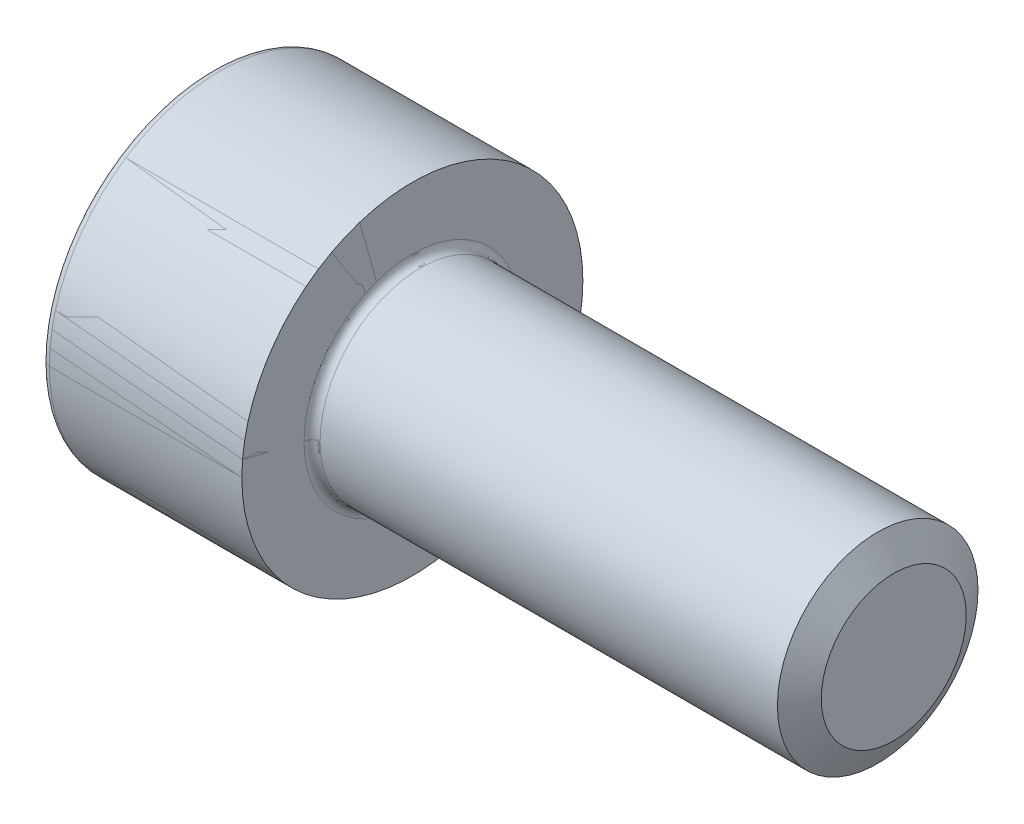
ISO-10303-21;
HEADER;
FILE_DESCRIPTION(('STEP AP214'),'2;1');
FILE_NAME('part.step','',(''),(''),'','','');
FILE_SCHEMA(('AUTOMOTIVE_DESIGN { 1 0 10303 214 1 1 1 1 }'));
ENDSEC;
DATA;
#1=APPLICATION_CONTEXT('core data for automotive mechanical design processes');
#2=APPLICATION_PROTOCOL_DEFINITION('international standard','automotive_design',2000,#1);
#3=PRODUCT_CONTEXT('',#1,'mechanical');
#4=PRODUCT('Part','Part','',(#3));
#5=PRODUCT_RELATED_PRODUCT_CATEGORY('part','',(#4));
#6=PRODUCT_DEFINITION_FORMATION('','',#4);
#7=PRODUCT_DEFINITION_CONTEXT('part definition',#1,'design');
#8=PRODUCT_DEFINITION('design','',#6,#7);
#9=PRODUCT_DEFINITION_SHAPE('','',#8);
#10=(LENGTH_UNIT() NAMED_UNIT(*) SI_UNIT(.MILLI.,.METRE.));
#11=(NAMED_UNIT(*) PLANE_ANGLE_UNIT() SI_UNIT($,.RADIAN.));
#12=(NAMED_UNIT(*) SI_UNIT($,.STERADIAN.) SOLID_ANGLE_UNIT());
#13=UNCERTAINTY_MEASURE_WITH_UNIT(LENGTH_MEASURE(1.E-05),#10,'distance_accuracy_value','');
#14=(GEOMETRIC_REPRESENTATION_CONTEXT(3) GLOBAL_UNCERTAINTY_ASSIGNED_CONTEXT((#13)) GLOBAL_UNIT_ASSIGNED_CONTEXT((#10,
#11,#12)) REPRESENTATION_CONTEXT('',''));
#15=CARTESIAN_POINT('',(0.,0.,0.));
#16=DIRECTION('',(0.,0.,1.));
#17=DIRECTION('',(1.,0.,0.));
#18=AXIS2_PLACEMENT_3D('',#15,#16,#17);
#19=CARTESIAN_POINT('',(0.2,0.,0.));
#20=DIRECTION('',(-1.,0.,0.));
#21=DIRECTION('',(0.,0.,1.));
#22=AXIS2_PLACEMENT_3D('',#19,#20,#21);
#23=TOROIDAL_SURFACE('',#22,4.05,0.2);
#24=CARTESIAN_POINT('',(0.2,0.,-4.05));
#25=DIRECTION('',(0.,1.,0.));
#26=DIRECTION('',(0.,0.,1.));
#27=AXIS2_PLACEMENT_3D('',#24,#25,#26);
#28=CIRCLE('',#27,0.2);
#29=CARTESIAN_POINT('',(0.2,0.,-4.25));
#30=VERTEX_POINT('',#29);
#31=CARTESIAN_POINT('',(0.,0.,-4.05));
#32=VERTEX_POINT('',#31);
#33=EDGE_CURVE('P0_E219',#30,#32,#28,.T.);
#34=ORIENTED_EDGE('',*,*,#33,.F.);
#35=CARTESIAN_POINT('',(0.2,0.,0.));
#36=DIRECTION('',(1.,0.,0.));
#37=DIRECTION('',(0.,0.,1.));
#38=AXIS2_PLACEMENT_3D('',#35,#36,#37);
#39=CIRCLE('',#38,4.25);
#40=CARTESIAN_POINT('',(0.2,0.,4.25));
#41=VERTEX_POINT('',#40);
#42=EDGE_CURVE('P0_E147',#41,#30,#39,.T.);
#43=ORIENTED_EDGE('',*,*,#42,.F.);
#44=CARTESIAN_POINT('',(0.2,0.,4.05));
#45=DIRECTION('',(0.,-1.,0.));
#46=DIRECTION('',(0.,0.,-1.));
#47=AXIS2_PLACEMENT_3D('',#44,#45,#46);
#48=CIRCLE('',#47,0.2);
#49=CARTESIAN_POINT('',(0.,0.,4.05));
#50=VERTEX_POINT('',#49);
#51=EDGE_CURVE('P0_E218',#41,#50,#48,.T.);
#52=ORIENTED_EDGE('',*,*,#51,.T.);
#53=CARTESIAN_POINT('',(0.,0.,0.));
#54=DIRECTION('',(-1.,0.,0.));
#55=DIRECTION('',(0.,0.,1.));
#56=AXIS2_PLACEMENT_3D('',#53,#54,#55);
#57=CIRCLE('',#56,4.05);
#58=EDGE_CURVE('P0_E178',#32,#50,#57,.T.);
#59=ORIENTED_EDGE('',*,*,#58,.F.);
#60=EDGE_LOOP('',(#34,#43,#52,#59));
#61=FACE_BOUND('',#60,.T.);
#62=ADVANCED_FACE('P0_F40',(#61),#23,.T.);
#63=CARTESIAN_POINT('',(2.5,-1.145,1.98319817466636));
#64=DIRECTION('',(-1.,0.,0.));
#65=DIRECTION('',(0.,0.,1.));
#66=AXIS2_PLACEMENT_3D('',#63,#64,#65);
#67=PLANE('',#66);
#68=DIRECTION('',(0.,0.5,0.866025403784439));
#69=VECTOR('',#68,1.);
#70=CARTESIAN_POINT('',(2.5,-2.29,0.));
#71=LINE('',#70,#69);
#72=CARTESIAN_POINT('',(2.5,-2.29,0.));
#73=VERTEX_POINT('',#72);
#74=CARTESIAN_POINT('',(2.5,-1.145,1.98319817466636));
#75=VERTEX_POINT('',#74);
#76=EDGE_CURVE('P0_E240',#73,#75,#71,.T.);
#77=ORIENTED_EDGE('',*,*,#76,.T.);
#78=DIRECTION('',(0.,1.,0.));
#79=VECTOR('',#78,1.);
#80=CARTESIAN_POINT('',(2.5,-1.145,1.98319817466636));
#81=LINE('',#80,#79);
#82=CARTESIAN_POINT('',(2.5,1.145,1.98319817466636));
#83=VERTEX_POINT('',#82);
#84=EDGE_CURVE('P0_E11',#75,#83,#81,.T.);
#85=ORIENTED_EDGE('',*,*,#84,.T.);
#86=DIRECTION('',(0.,0.5,-0.866025403784439));
#87=VECTOR('',#86,1.);
#88=CARTESIAN_POINT('',(2.5,1.145,1.98319817466636));
#89=LINE('',#88,#87);
#90=CARTESIAN_POINT('',(2.5,2.29,0.));
#91=VERTEX_POINT('',#90);
#92=EDGE_CURVE('P0_E187',#83,#91,#89,.T.);
#93=ORIENTED_EDGE('',*,*,#92,.T.);
#94=DIRECTION('',(0.,-0.5,-0.866025403784439));
#95=VECTOR('',#94,1.);
#96=CARTESIAN_POINT('',(2.5,2.29,0.));
#97=LINE('',#96,#95);
#98=CARTESIAN_POINT('',(2.5,1.145,-1.98319817466636));
#99=VERTEX_POINT('',#98);
#100=EDGE_CURVE('P0_E203',#91,#99,#97,.T.);
#101=ORIENTED_EDGE('',*,*,#100,.T.);
#102=DIRECTION('',(0.,-1.,0.));
#103=VECTOR('',#102,1.);
#104=CARTESIAN_POINT('',(2.5,1.145,-1.98319817466636));
#105=LINE('',#104,#103);
#106=CARTESIAN_POINT('',(2.5,-1.145,-1.98319817466636));
#107=VERTEX_POINT('',#106);
#108=EDGE_CURVE('P0_E204',#99,#107,#105,.T.);
#109=ORIENTED_EDGE('',*,*,#108,.T.);
#110=DIRECTION('',(0.,-0.5,0.866025403784439));
#111=VECTOR('',#110,1.);
#112=CARTESIAN_POINT('',(2.5,-1.145,-1.98319817466636));
#113=LINE('',#112,#111);
#114=EDGE_CURVE('P0_E244',#107,#73,#113,.T.);
#115=ORIENTED_EDGE('',*,*,#114,.T.);
#116=EDGE_LOOP('',(#77,#85,#93,#101,#109,#115));
#117=FACE_BOUND('',#116,.T.);
#118=ADVANCED_FACE('P0_F293',(#117),#67,.T.);
#119=CARTESIAN_POINT('',(2.5,-1.145,1.98319817466636));
#120=DIRECTION('',(0.,0.,1.));
#121=DIRECTION('',(0.,-1.,0.));
#122=AXIS2_PLACEMENT_3D('',#119,#120,#121);
#123=PLANE('',#122);
#124=DIRECTION('',(0.,1.,0.));
#125=VECTOR('',#124,1.);
#126=CARTESIAN_POINT('',(0.,-1.145,1.98319817466636));
#127=LINE('',#126,#125);
#128=CARTESIAN_POINT('',(0.,-1.145,1.98319817466636));
#129=VERTEX_POINT('',#128);
#130=CARTESIAN_POINT('',(0.,1.145,1.98319817466636));
#131=VERTEX_POINT('',#130);
#132=EDGE_CURVE('P0_E245',#129,#131,#127,.T.);
#133=ORIENTED_EDGE('',*,*,#132,.T.);
#134=DIRECTION('',(-1.,0.,0.));
#135=VECTOR('',#134,1.);
#136=CARTESIAN_POINT('',(2.5,1.145,1.98319817466636));
#137=LINE('',#136,#135);
#138=EDGE_CURVE('P0_E51',#83,#131,#137,.T.);
#139=ORIENTED_EDGE('',*,*,#138,.F.);
#140=ORIENTED_EDGE('',*,*,#84,.F.);
#141=DIRECTION('',(-1.,0.,0.));
#142=VECTOR('',#141,1.);
#143=CARTESIAN_POINT('',(2.5,-1.145,1.98319817466636));
#144=LINE('',#143,#142);
#145=EDGE_CURVE('P0_E236',#75,#129,#144,.T.);
#146=ORIENTED_EDGE('',*,*,#145,.T.);
#147=EDGE_LOOP('',(#133,#139,#140,#146));
#148=FACE_BOUND('',#147,.T.);
#149=ADVANCED_FACE('P0_F302',(#148),#123,.F.);
#150=CARTESIAN_POINT('',(2.5,1.145,1.98319817466636));
#151=DIRECTION('',(0.,0.866025403784439,0.5));
#152=DIRECTION('',(1.,0.,0.));
#153=AXIS2_PLACEMENT_3D('',#150,#151,#152);
#154=PLANE('',#153);
#155=DIRECTION('',(0.,0.5,-0.866025403784439));
#156=VECTOR('',#155,1.);
#157=CARTESIAN_POINT('',(0.,1.145,1.98319817466636));
#158=LINE('',#157,#156);
#159=CARTESIAN_POINT('',(0.,2.29,0.));
#160=VERTEX_POINT('',#159);
#161=EDGE_CURVE('P0_E194',#131,#160,#158,.T.);
#162=ORIENTED_EDGE('',*,*,#161,.T.);
#163=DIRECTION('',(-1.,0.,0.));
#164=VECTOR('',#163,1.);
#165=CARTESIAN_POINT('',(2.5,2.29,0.));
#166=LINE('',#165,#164);
#167=EDGE_CURVE('P0_E189',#91,#160,#166,.T.);
#168=ORIENTED_EDGE('',*,*,#167,.F.);
#169=ORIENTED_EDGE('',*,*,#92,.F.);
#170=ORIENTED_EDGE('',*,*,#138,.T.);
#171=EDGE_LOOP('',(#162,#168,#169,#170));
#172=FACE_BOUND('',#171,.T.);
#173=ADVANCED_FACE('P0_F274',(#172),#154,.F.);
#174=CARTESIAN_POINT('',(2.5,2.29,0.));
#175=DIRECTION('',(0.,0.866025403784439,-0.5));
#176=DIRECTION('',(-1.,0.,0.));
#177=AXIS2_PLACEMENT_3D('',#174,#175,#176);
#178=PLANE('',#177);
#179=DIRECTION('',(0.,-0.5,-0.866025403784439));
#180=VECTOR('',#179,1.);
#181=CARTESIAN_POINT('',(0.,2.29,0.));
#182=LINE('',#181,#180);
#183=CARTESIAN_POINT('',(0.,1.145,-1.98319817466636));
#184=VERTEX_POINT('',#183);
#185=EDGE_CURVE('P0_E190',#160,#184,#182,.T.);
#186=ORIENTED_EDGE('',*,*,#185,.T.);
#187=DIRECTION('',(-1.,0.,0.));
#188=VECTOR('',#187,1.);
#189=CARTESIAN_POINT('',(2.5,1.145,-1.98319817466636));
#190=LINE('',#189,#188);
#191=EDGE_CURVE('P0_E199',#99,#184,#190,.T.);
#192=ORIENTED_EDGE('',*,*,#191,.F.);
#193=ORIENTED_EDGE('',*,*,#100,.F.);
#194=ORIENTED_EDGE('',*,*,#167,.T.);
#195=EDGE_LOOP('',(#186,#192,#193,#194));
#196=FACE_BOUND('',#195,.T.);
#197=ADVANCED_FACE('P0_F286',(#196),#178,.F.);
#198=CARTESIAN_POINT('',(2.5,1.145,-1.98319817466636));
#199=DIRECTION('',(0.,0.,-1.));
#200=DIRECTION('',(0.,-1.,0.));
#201=AXIS2_PLACEMENT_3D('',#198,#199,#200);
#202=PLANE('',#201);
#203=DIRECTION('',(0.,-1.,0.));
#204=VECTOR('',#203,1.);
#205=CARTESIAN_POINT('',(0.,1.145,-1.98319817466636));
#206=LINE('',#205,#204);
#207=CARTESIAN_POINT('',(0.,-1.145,-1.98319817466636));
#208=VERTEX_POINT('',#207);
#209=EDGE_CURVE('P0_E195',#184,#208,#206,.T.);
#210=ORIENTED_EDGE('',*,*,#209,.T.);
#211=DIRECTION('',(-1.,0.,0.));
#212=VECTOR('',#211,1.);
#213=CARTESIAN_POINT('',(2.5,-1.145,-1.98319817466636));
#214=LINE('',#213,#212);
#215=EDGE_CURVE('P0_E241',#107,#208,#214,.T.);
#216=ORIENTED_EDGE('',*,*,#215,.F.);
#217=ORIENTED_EDGE('',*,*,#108,.F.);
#218=ORIENTED_EDGE('',*,*,#191,.T.);
#219=EDGE_LOOP('',(#210,#216,#217,#218));
#220=FACE_BOUND('',#219,.T.);
#221=ADVANCED_FACE('P0_F290',(#220),#202,.F.);
#222=CARTESIAN_POINT('',(2.5,-1.145,-1.98319817466636));
#223=DIRECTION('',(0.,-0.866025403784439,-0.5));
#224=DIRECTION('',(0.,0.5,-0.866025403784439));
#225=AXIS2_PLACEMENT_3D('',#222,#223,#224);
#226=PLANE('',#225);
#227=DIRECTION('',(0.,-0.5,0.866025403784439));
#228=VECTOR('',#227,1.);
#229=CARTESIAN_POINT('',(0.,-1.145,-1.98319817466636));
#230=LINE('',#229,#228);
#231=CARTESIAN_POINT('',(0.,-2.29,0.));
#232=VERTEX_POINT('',#231);
#233=EDGE_CURVE('P0_E213',#208,#232,#230,.T.);
#234=ORIENTED_EDGE('',*,*,#233,.T.);
#235=DIRECTION('',(-1.,0.,0.));
#236=VECTOR('',#235,1.);
#237=CARTESIAN_POINT('',(2.5,-2.29,0.));
#238=LINE('',#237,#236);
#239=EDGE_CURVE('P0_E252',#73,#232,#238,.T.);
#240=ORIENTED_EDGE('',*,*,#239,.F.);
#241=ORIENTED_EDGE('',*,*,#114,.F.);
#242=ORIENTED_EDGE('',*,*,#215,.T.);
#243=EDGE_LOOP('',(#234,#240,#241,#242));
#244=FACE_BOUND('',#243,.T.);
#245=ADVANCED_FACE('P0_F298',(#244),#226,.F.);
#246=CARTESIAN_POINT('',(2.5,-2.29,0.));
#247=DIRECTION('',(0.,-0.866025403784439,0.5));
#248=DIRECTION('',(-1.,0.,0.));
#249=AXIS2_PLACEMENT_3D('',#246,#247,#248);
#250=PLANE('',#249);
#251=DIRECTION('',(0.,0.5,0.866025403784439));
#252=VECTOR('',#251,1.);
#253=CARTESIAN_POINT('',(0.,-2.29,0.));
#254=LINE('',#253,#252);
#255=EDGE_CURVE('P0_E225',#232,#129,#254,.T.);
#256=ORIENTED_EDGE('',*,*,#255,.T.);
#257=ORIENTED_EDGE('',*,*,#145,.F.);
#258=ORIENTED_EDGE('',*,*,#76,.F.);
#259=ORIENTED_EDGE('',*,*,#239,.T.);
#260=EDGE_LOOP('',(#256,#257,#258,#259));
#261=FACE_BOUND('',#260,.T.);
#262=ADVANCED_FACE('P0_F300',(#261),#250,.F.);
#263=CARTESIAN_POINT('',(5.2,0.,0.));
#264=DIRECTION('',(1.,0.,0.));
#265=DIRECTION('',(0.,0.,-1.));
#266=AXIS2_PLACEMENT_3D('',#263,#264,#265);
#267=TOROIDAL_SURFACE('',#266,2.7,0.2);
#268=CARTESIAN_POINT('',(5.2,0.,2.7));
#269=DIRECTION('',(0.,1.,0.));
#270=DIRECTION('',(0.,0.,1.));
#271=AXIS2_PLACEMENT_3D('',#268,#269,#270);
#272=CIRCLE('',#271,0.2);
#273=CARTESIAN_POINT('',(5.2,0.,2.5));
#274=VERTEX_POINT('',#273);
#275=CARTESIAN_POINT('',(5.,0.,2.7));
#276=VERTEX_POINT('',#275);
#277=EDGE_CURVE('P0_E209',#274,#276,#272,.T.);
#278=ORIENTED_EDGE('',*,*,#277,.F.);
#279=CARTESIAN_POINT('',(5.2,0.,0.));
#280=DIRECTION('',(1.,0.,0.));
#281=DIRECTION('',(0.,0.,-1.));
#282=AXIS2_PLACEMENT_3D('',#279,#280,#281);
#283=CIRCLE('',#282,2.5);
#284=CARTESIAN_POINT('',(5.2,0.,-2.5));
#285=VERTEX_POINT('',#284);
#286=EDGE_CURVE('P0_E171',#285,#274,#283,.T.);
#287=ORIENTED_EDGE('',*,*,#286,.F.);
#288=CARTESIAN_POINT('',(5.2,0.,-2.7));
#289=DIRECTION('',(0.,-1.,0.));
#290=DIRECTION('',(0.,0.,-1.));
#291=AXIS2_PLACEMENT_3D('',#288,#289,#290);
#292=CIRCLE('',#291,0.2);
#293=CARTESIAN_POINT('',(5.,0.,-2.7));
#294=VERTEX_POINT('',#293);
#295=EDGE_CURVE('P0_E44',#285,#294,#292,.T.);
#296=ORIENTED_EDGE('',*,*,#295,.T.);
#297=CARTESIAN_POINT('',(5.,0.,0.));
#298=DIRECTION('',(1.,0.,0.));
#299=DIRECTION('',(0.,0.,-1.));
#300=AXIS2_PLACEMENT_3D('',#297,#298,#299);
#301=CIRCLE('',#300,2.7);
#302=EDGE_CURVE('P0_E133',#294,#276,#301,.T.);
#303=ORIENTED_EDGE('',*,*,#302,.T.);
#304=EDGE_LOOP('',(#278,#287,#296,#303));
#305=FACE_BOUND('',#304,.T.);
#306=ADVANCED_FACE('P0_F336',(#305),#267,.F.);
#307=CARTESIAN_POINT('',(5.,4.25,0.));
#308=DIRECTION('',(1.,0.,0.));
#309=DIRECTION('',(0.,1.,0.));
#310=AXIS2_PLACEMENT_3D('',#307,#308,#309);
#311=PLANE('',#310);
#312=ORIENTED_EDGE('',*,*,#302,.F.);
#313=CARTESIAN_POINT('',(5.,0.,0.));
#314=DIRECTION('',(1.,0.,0.));
#315=DIRECTION('',(0.,0.,-1.));
#316=AXIS2_PLACEMENT_3D('',#313,#314,#315);
#317=CIRCLE('',#316,2.7);
#318=EDGE_CURVE('P0_E205',#276,#294,#317,.T.);
#319=ORIENTED_EDGE('',*,*,#318,.F.);
#320=EDGE_LOOP('',(#312,#319));
#321=FACE_BOUND('',#320,.T.);
#322=CARTESIAN_POINT('',(5.,0.,0.));
#323=DIRECTION('',(1.,0.,0.));
#324=DIRECTION('',(0.,0.,-1.));
#325=AXIS2_PLACEMENT_3D('',#322,#323,#324);
#326=CIRCLE('',#325,4.25);
#327=CARTESIAN_POINT('',(5.,0.,-4.25));
#328=VERTEX_POINT('',#327);
#329=CARTESIAN_POINT('',(5.,0.,4.25));
#330=VERTEX_POINT('',#329);
#331=EDGE_CURVE('P0_E198',#328,#330,#326,.T.);
#332=ORIENTED_EDGE('',*,*,#331,.T.);
#333=CARTESIAN_POINT('',(5.,0.,0.));
#334=DIRECTION('',(1.,0.,0.));
#335=DIRECTION('',(0.,0.,-1.));
#336=AXIS2_PLACEMENT_3D('',#333,#334,#335);
#337=CIRCLE('',#336,4.25);
#338=EDGE_CURVE('P0_E237',#330,#328,#337,.T.);
#339=ORIENTED_EDGE('',*,*,#338,.T.);
#340=EDGE_LOOP('',(#332,#339));
#341=FACE_BOUND('',#340,.T.);
#342=ADVANCED_FACE('P0_F321',(#321,#341),#311,.T.);
#343=CARTESIAN_POINT('',(0.,0.,0.));
#344=DIRECTION('',(1.,0.,0.));
#345=DIRECTION('',(0.,0.,-1.));
#346=AXIS2_PLACEMENT_3D('',#343,#344,#345);
#347=CYLINDRICAL_SURFACE('',#346,4.25);
#348=DIRECTION('',(1.,0.,0.));
#349=VECTOR('',#348,1.);
#350=CARTESIAN_POINT('',(0.,0.,4.25));
#351=LINE('',#350,#349);
#352=EDGE_CURVE('P0_E185',#41,#330,#351,.T.);
#353=ORIENTED_EDGE('',*,*,#352,.F.);
#354=ORIENTED_EDGE('',*,*,#42,.T.);
#355=DIRECTION('',(1.,0.,0.));
#356=VECTOR('',#355,1.);
#357=CARTESIAN_POINT('',(0.,0.,-4.25));
#358=LINE('',#357,#356);
#359=EDGE_CURVE('P0_E181',#30,#328,#358,.T.);
#360=ORIENTED_EDGE('',*,*,#359,.T.);
#361=ORIENTED_EDGE('',*,*,#338,.F.);
#362=EDGE_LOOP('',(#353,#354,#360,#361));
#363=FACE_BOUND('',#362,.T.);
#364=ADVANCED_FACE('P0_F319',(#363),#347,.T.);
#365=CARTESIAN_POINT('',(0.,0.,0.));
#366=DIRECTION('',(-1.,0.,0.));
#367=DIRECTION('',(0.,0.,1.));
#368=AXIS2_PLACEMENT_3D('',#365,#366,#367);
#369=PLANE('',#368);
#370=ORIENTED_EDGE('',*,*,#255,.F.);
#371=ORIENTED_EDGE('',*,*,#233,.F.);
#372=ORIENTED_EDGE('',*,*,#209,.F.);
#373=ORIENTED_EDGE('',*,*,#185,.F.);
#374=ORIENTED_EDGE('',*,*,#161,.F.);
#375=ORIENTED_EDGE('',*,*,#132,.F.);
#376=EDGE_LOOP('',(#370,#371,#372,#373,#374,#375));
#377=FACE_BOUND('',#376,.T.);
#378=CARTESIAN_POINT('',(0.,0.,0.));
#379=DIRECTION('',(-1.,0.,0.));
#380=DIRECTION('',(0.,0.,1.));
#381=AXIS2_PLACEMENT_3D('',#378,#379,#380);
#382=CIRCLE('',#381,4.05);
#383=EDGE_CURVE('P0_E214',#50,#32,#382,.T.);
#384=ORIENTED_EDGE('',*,*,#383,.T.);
#385=ORIENTED_EDGE('',*,*,#58,.T.);
#386=EDGE_LOOP('',(#384,#385));
#387=FACE_BOUND('',#386,.T.);
#388=ADVANCED_FACE('P0_F281',(#377,#387),#369,.T.);
#389=CARTESIAN_POINT('',(0.,0.,0.));
#390=DIRECTION('',(1.,0.,0.));
#391=DIRECTION('',(0.,0.,-1.));
#392=AXIS2_PLACEMENT_3D('',#389,#390,#391);
#393=CYLINDRICAL_SURFACE('',#392,2.5);
#394=ORIENTED_EDGE('',*,*,#286,.T.);
#395=DIRECTION('',(1.,0.,0.));
#396=VECTOR('',#395,1.);
#397=CARTESIAN_POINT('',(0.,0.,2.5));
#398=LINE('',#397,#396);
#399=CARTESIAN_POINT('',(14.6,0.,2.5));
#400=VERTEX_POINT('',#399);
#401=EDGE_CURVE('P0_E167',#274,#400,#398,.T.);
#402=ORIENTED_EDGE('',*,*,#401,.T.);
#403=ORIENTED_EDGE('',*,*,#401,.F.);
#404=CARTESIAN_POINT('',(5.2,0.,0.));
#405=DIRECTION('',(1.,0.,0.));
#406=DIRECTION('',(0.,0.,-1.));
#407=AXIS2_PLACEMENT_3D('',#404,#405,#406);
#408=CIRCLE('',#407,2.5);
#409=EDGE_CURVE('P0_E226',#274,#285,#408,.T.);
#410=ORIENTED_EDGE('',*,*,#409,.T.);
#411=DIRECTION('',(1.,0.,0.));
#412=VECTOR('',#411,1.);
#413=CARTESIAN_POINT('',(0.,0.,-2.5));
#414=LINE('',#413,#412);
#415=CARTESIAN_POINT('',(14.6,0.,-2.5));
#416=VERTEX_POINT('',#415);
#417=EDGE_CURVE('P0_E122',#285,#416,#414,.T.);
#418=ORIENTED_EDGE('',*,*,#417,.T.);
#419=ORIENTED_EDGE('',*,*,#417,.F.);
#420=EDGE_LOOP('',(#394,#402,#403,#410,#418,#419));
#421=FACE_BOUND('',#420,.T.);
#422=CARTESIAN_POINT('',(16.6,0.,0.));
#423=DIRECTION('',(-1.,0.,0.));
#424=DIRECTION('',(0.,0.,1.));
#425=AXIS2_PLACEMENT_3D('',#422,#423,#424);
#426=CIRCLE('',#425,2.5);
#427=CARTESIAN_POINT('',(16.6,0.,2.5));
#428=VERTEX_POINT('',#427);
#429=EDGE_CURVE('P0_E370',#428,#428,#426,.T.);
#430=ORIENTED_EDGE('',*,*,#429,.T.);
#431=EDGE_LOOP('',(#430));
#432=FACE_BOUND('',#431,.T.);
#433=ADVANCED_FACE('P0_F168',(#421,#432),#393,.T.);
#434=CARTESIAN_POINT('',(0.,0.,0.));
#435=DIRECTION('',(1.,0.,0.));
#436=DIRECTION('',(0.,0.,-1.));
#437=AXIS2_PLACEMENT_3D('',#434,#435,#436);
#438=CYLINDRICAL_SURFACE('',#437,4.25);
#439=CARTESIAN_POINT('',(0.2,0.,0.));
#440=DIRECTION('',(1.,0.,0.));
#441=DIRECTION('',(0.,0.,1.));
#442=AXIS2_PLACEMENT_3D('',#439,#440,#441);
#443=CIRCLE('',#442,4.25);
#444=EDGE_CURVE('P0_E358',#30,#41,#443,.T.);
#445=ORIENTED_EDGE('',*,*,#444,.T.);
#446=ORIENTED_EDGE('',*,*,#352,.T.);
#447=ORIENTED_EDGE('',*,*,#331,.F.);
#448=ORIENTED_EDGE('',*,*,#359,.F.);
#449=EDGE_LOOP('',(#445,#446,#447,#448));
#450=FACE_BOUND('',#449,.T.);
#451=ADVANCED_FACE('P0_F42',(#450),#438,.T.);
#452=CARTESIAN_POINT('',(5.2,0.,0.));
#453=DIRECTION('',(1.,0.,0.));
#454=DIRECTION('',(0.,0.,-1.));
#455=AXIS2_PLACEMENT_3D('',#452,#453,#454);
#456=TOROIDAL_SURFACE('',#455,2.7,0.2);
#457=ORIENTED_EDGE('',*,*,#409,.F.);
#458=ORIENTED_EDGE('',*,*,#277,.T.);
#459=ORIENTED_EDGE('',*,*,#318,.T.);
#460=ORIENTED_EDGE('',*,*,#295,.F.);
#461=EDGE_LOOP('',(#457,#458,#459,#460));
#462=FACE_BOUND('',#461,.T.);
#463=ADVANCED_FACE('P0_F331',(#462),#456,.F.);
#464=CARTESIAN_POINT('',(0.2,0.,0.));
#465=DIRECTION('',(-1.,0.,0.));
#466=DIRECTION('',(0.,0.,1.));
#467=AXIS2_PLACEMENT_3D('',#464,#465,#466);
#468=TOROIDAL_SURFACE('',#467,4.05,0.2);
#469=ORIENTED_EDGE('',*,*,#444,.F.);
#470=ORIENTED_EDGE('',*,*,#33,.T.);
#471=ORIENTED_EDGE('',*,*,#383,.F.);
#472=ORIENTED_EDGE('',*,*,#51,.F.);
#473=EDGE_LOOP('',(#469,#470,#471,#472));
#474=FACE_BOUND('',#473,.T.);
#475=ADVANCED_FACE('P0_F327',(#474),#468,.T.);
#476=CARTESIAN_POINT('',(17.,0.,0.));
#477=DIRECTION('',(-1.,0.,0.));
#478=DIRECTION('',(0.,0.,1.));
#479=AXIS2_PLACEMENT_3D('',#476,#477,#478);
#480=PLANE('',#479);
#481=CARTESIAN_POINT('',(17.,0.,0.));
#482=DIRECTION('',(-1.,0.,0.));
#483=DIRECTION('',(0.,0.,1.));
#484=AXIS2_PLACEMENT_3D('',#481,#482,#483);
#485=CIRCLE('',#484,1.8072);
#486=CARTESIAN_POINT('',(17.,0.,1.8072));
#487=VERTEX_POINT('',#486);
#488=EDGE_CURVE('P0_E360',#487,#487,#485,.T.);
#489=ORIENTED_EDGE('',*,*,#488,.F.);
#490=EDGE_LOOP('',(#489));
#491=FACE_BOUND('',#490,.T.);
#492=ADVANCED_FACE('P0_F330',(#491),#480,.F.);
#493=CARTESIAN_POINT('',(17.,0.,0.));
#494=DIRECTION('',(-1.,0.,0.));
#495=DIRECTION('',(0.,0.,1.));
#496=AXIS2_PLACEMENT_3D('',#493,#494,#495);
#497=CONICAL_SURFACE('',#496,1.8072,1.04718484902493);
#498=ORIENTED_EDGE('',*,*,#429,.F.);
#499=EDGE_LOOP('',(#498));
#500=FACE_BOUND('',#499,.T.);
#501=ORIENTED_EDGE('',*,*,#488,.T.);
#502=EDGE_LOOP('',(#501));
#503=FACE_BOUND('',#502,.T.);
#504=ADVANCED_FACE('P0_F374',(#500,#503),#497,.T.);
#505=CLOSED_SHELL('',(#62,#118,#149,#173,#197,#221,#245,#262,#306,#342,#364,#388,#433,#451,#463,
#475,#492,#504));
#506=MANIFOLD_SOLID_BREP('P0_B2',#505);
#507=CARTESIAN_POINT('',(15.,2.5,0.));
#508=DIRECTION('',(1.,0.,0.));
#509=DIRECTION('',(0.,1.,0.));
#510=AXIS2_PLACEMENT_3D('',#507,#508,#509);
#511=PLANE('',#510);
#512=CARTESIAN_POINT('',(15.,0.,0.));
#513=DIRECTION('',(-1.,0.,0.));
#514=DIRECTION('',(0.,0.,1.));
#515=AXIS2_PLACEMENT_3D('',#512,#513,#514);
#516=CIRCLE('',#515,1.8072);
#517=CARTESIAN_POINT('',(15.,0.,1.8072));
#518=VERTEX_POINT('',#517);
#519=CARTESIAN_POINT('',(15.,0.,-1.8072));
#520=VERTEX_POINT('',#519);
#521=EDGE_CURVE('P1_E198',#518,#520,#516,.T.);
#522=ORIENTED_EDGE('',*,*,#521,.F.);
#523=CARTESIAN_POINT('',(15.,0.,0.));
#524=DIRECTION('',(-1.,0.,0.));
#525=DIRECTION('',(0.,0.,1.));
#526=AXIS2_PLACEMENT_3D('',#523,#524,#525);
#527=CIRCLE('',#526,1.8072);
#528=EDGE_CURVE('P1_E11',#520,#518,#527,.T.);
#529=ORIENTED_EDGE('',*,*,#528,.F.);
#530=EDGE_LOOP('',(#522,#529));
#531=FACE_BOUND('',#530,.T.);
#532=ADVANCED_FACE('P1_F16',(#531),#511,.T.);
#533=CARTESIAN_POINT('',(14.6,0.,0.));
#534=DIRECTION('',(-1.,0.,0.));
#535=DIRECTION('',(0.,0.,1.));
#536=AXIS2_PLACEMENT_3D('',#533,#534,#535);
#537=CONICAL_SURFACE('',#536,2.5,1.04718484902493);
#538=DIRECTION('',(-0.500011000363013,0.,-0.86601905262874));
#539=VECTOR('',#538,1.);
#540=CARTESIAN_POINT('',(14.6,0.,-2.5));
#541=LINE('',#540,#539);
#542=CARTESIAN_POINT('',(14.6,0.,-2.5));
#543=VERTEX_POINT('',#542);
#544=EDGE_CURVE('P1_E171',#520,#543,#541,.T.);
#545=ORIENTED_EDGE('',*,*,#544,.F.);
#546=ORIENTED_EDGE('',*,*,#528,.T.);
#547=DIRECTION('',(-0.500011000363013,0.,0.86601905262874));
#548=VECTOR('',#547,1.);
#549=CARTESIAN_POINT('',(14.6,0.,2.5));
#550=LINE('',#549,#548);
#551=CARTESIAN_POINT('',(14.6,0.,2.5));
#552=VERTEX_POINT('',#551);
#553=EDGE_CURVE('P1_E20',#518,#552,#550,.T.);
#554=ORIENTED_EDGE('',*,*,#553,.T.);
#555=CARTESIAN_POINT('',(14.6,0.,0.));
#556=DIRECTION('',(-1.,0.,0.));
#557=DIRECTION('',(0.,0.,1.));
#558=AXIS2_PLACEMENT_3D('',#555,#556,#557);
#559=CIRCLE('',#558,2.5);
#560=EDGE_CURVE('P1_E182',#543,#552,#559,.T.);
#561=ORIENTED_EDGE('',*,*,#560,.F.);
#562=EDGE_LOOP('',(#545,#546,#554,#561));
#563=FACE_BOUND('',#562,.T.);
#564=ADVANCED_FACE('P1_F18',(#563),#537,.T.);
#565=CARTESIAN_POINT('',(0.2,0.,0.));
#566=DIRECTION('',(-1.,0.,0.));
#567=DIRECTION('',(0.,0.,1.));
#568=AXIS2_PLACEMENT_3D('',#565,#566,#567);
#569=TOROIDAL_SURFACE('',#568,4.05,0.2);
#570=CARTESIAN_POINT('',(0.2,0.,-4.05));
#571=DIRECTION('',(0.,1.,0.));
#572=DIRECTION('',(0.,0.,1.));
#573=AXIS2_PLACEMENT_3D('',#570,#571,#572);
#574=CIRCLE('',#573,0.2);
#575=CARTESIAN_POINT('',(0.2,0.,-4.25));
#576=VERTEX_POINT('',#575);
#577=CARTESIAN_POINT('',(0.,0.,-4.05));
#578=VERTEX_POINT('',#577);
#579=EDGE_CURVE('P1_E336',#576,#578,#574,.T.);
#580=ORIENTED_EDGE('',*,*,#579,.F.);
#581=CARTESIAN_POINT('',(0.2,0.,0.));
#582=DIRECTION('',(1.,0.,0.));
#583=DIRECTION('',(0.,0.,1.));
#584=AXIS2_PLACEMENT_3D('',#581,#582,#583);
#585=CIRCLE('',#584,4.25);
#586=CARTESIAN_POINT('',(0.2,0.,4.25));
#587=VERTEX_POINT('',#586);
#588=EDGE_CURVE('P1_E146',#587,#576,#585,.T.);
#589=ORIENTED_EDGE('',*,*,#588,.F.);
#590=CARTESIAN_POINT('',(0.2,0.,4.05));
#591=DIRECTION('',(0.,-1.,0.));
#592=DIRECTION('',(0.,0.,-1.));
#593=AXIS2_PLACEMENT_3D('',#590,#591,#592);
#594=CIRCLE('',#593,0.2);
#595=CARTESIAN_POINT('',(0.,0.,4.05));
#596=VERTEX_POINT('',#595);
#597=EDGE_CURVE('P1_E365',#587,#596,#594,.T.);
#598=ORIENTED_EDGE('',*,*,#597,.T.);
#599=CARTESIAN_POINT('',(0.,0.,0.));
#600=DIRECTION('',(-1.,0.,0.));
#601=DIRECTION('',(0.,0.,1.));
#602=AXIS2_PLACEMENT_3D('',#599,#600,#601);
#603=CIRCLE('',#602,4.05);
#604=EDGE_CURVE('P1_E217',#578,#596,#603,.T.);
#605=ORIENTED_EDGE('',*,*,#604,.F.);
#606=EDGE_LOOP('',(#580,#589,#598,#605));
#607=FACE_BOUND('',#606,.T.);
#608=ADVANCED_FACE('P1_F276',(#607),#569,.T.);
#609=CARTESIAN_POINT('',(2.5,-1.145,1.98319817466636));
#610=DIRECTION('',(-1.,0.,0.));
#611=DIRECTION('',(0.,0.,1.));
#612=AXIS2_PLACEMENT_3D('',#609,#610,#611);
#613=PLANE('',#612);
#614=DIRECTION('',(0.,0.5,0.866025403784439));
#615=VECTOR('',#614,1.);
#616=CARTESIAN_POINT('',(2.5,-2.29,0.));
#617=LINE('',#616,#615);
#618=CARTESIAN_POINT('',(2.5,-2.29,0.));
#619=VERTEX_POINT('',#618);
#620=CARTESIAN_POINT('',(2.5,-1.145,1.98319817466636));
#621=VERTEX_POINT('',#620);
#622=EDGE_CURVE('P1_E114',#619,#621,#617,.T.);
#623=ORIENTED_EDGE('',*,*,#622,.T.);
#624=DIRECTION('',(0.,1.,0.));
#625=VECTOR('',#624,1.);
#626=CARTESIAN_POINT('',(2.5,-1.145,1.98319817466636));
#627=LINE('',#626,#625);
#628=CARTESIAN_POINT('',(2.5,1.145,1.98319817466636));
#629=VERTEX_POINT('',#628);
#630=EDGE_CURVE('P1_E27',#621,#629,#627,.T.);
#631=ORIENTED_EDGE('',*,*,#630,.T.);
#632=DIRECTION('',(0.,0.5,-0.866025403784439));
#633=VECTOR('',#632,1.);
#634=CARTESIAN_POINT('',(2.5,1.145,1.98319817466636));
#635=LINE('',#634,#633);
#636=CARTESIAN_POINT('',(2.5,2.29,0.));
#637=VERTEX_POINT('',#636);
#638=EDGE_CURVE('P1_E173',#629,#637,#635,.T.);
#639=ORIENTED_EDGE('',*,*,#638,.T.);
#640=DIRECTION('',(0.,-0.5,-0.866025403784439));
#641=VECTOR('',#640,1.);
#642=CARTESIAN_POINT('',(2.5,2.29,0.));
#643=LINE('',#642,#641);
#644=CARTESIAN_POINT('',(2.5,1.145,-1.98319817466636));
#645=VERTEX_POINT('',#644);
#646=EDGE_CURVE('P1_E183',#637,#645,#643,.T.);
#647=ORIENTED_EDGE('',*,*,#646,.T.);
#648=DIRECTION('',(0.,-1.,0.));
#649=VECTOR('',#648,1.);
#650=CARTESIAN_POINT('',(2.5,1.145,-1.98319817466636));
#651=LINE('',#650,#649);
#652=CARTESIAN_POINT('',(2.5,-1.145,-1.98319817466636));
#653=VERTEX_POINT('',#652);
#654=EDGE_CURVE('P1_E142',#645,#653,#651,.T.);
#655=ORIENTED_EDGE('',*,*,#654,.T.);
#656=DIRECTION('',(0.,-0.5,0.866025403784439));
#657=VECTOR('',#656,1.);
#658=CARTESIAN_POINT('',(2.5,-1.145,-1.98319817466636));
#659=LINE('',#658,#657);
#660=EDGE_CURVE('P1_E117',#653,#619,#659,.T.);
#661=ORIENTED_EDGE('',*,*,#660,.T.);
#662=EDGE_LOOP('',(#623,#631,#639,#647,#655,#661));
#663=FACE_BOUND('',#662,.T.);
#664=ADVANCED_FACE('P1_F115',(#663),#613,.T.);
#665=CARTESIAN_POINT('',(2.5,-1.145,1.98319817466636));
#666=DIRECTION('',(0.,0.,1.));
#667=DIRECTION('',(0.,-1.,0.));
#668=AXIS2_PLACEMENT_3D('',#665,#666,#667);
#669=PLANE('',#668);
#670=DIRECTION('',(0.,1.,0.));
#671=VECTOR('',#670,1.);
#672=CARTESIAN_POINT('',(0.,-1.145,1.98319817466636));
#673=LINE('',#672,#671);
#674=CARTESIAN_POINT('',(0.,-1.145,1.98319817466636));
#675=VERTEX_POINT('',#674);
#676=CARTESIAN_POINT('',(0.,1.145,1.98319817466636));
#677=VERTEX_POINT('',#676);
#678=EDGE_CURVE('P1_E143',#675,#677,#673,.T.);
#679=ORIENTED_EDGE('',*,*,#678,.T.);
#680=DIRECTION('',(-1.,0.,0.));
#681=VECTOR('',#680,1.);
#682=CARTESIAN_POINT('',(2.5,1.145,1.98319817466636));
#683=LINE('',#682,#681);
#684=EDGE_CURVE('P1_E109',#629,#677,#683,.T.);
#685=ORIENTED_EDGE('',*,*,#684,.F.);
#686=ORIENTED_EDGE('',*,*,#630,.F.);
#687=DIRECTION('',(-1.,0.,0.));
#688=VECTOR('',#687,1.);
#689=CARTESIAN_POINT('',(2.5,-1.145,1.98319817466636));
#690=LINE('',#689,#688);
#691=EDGE_CURVE('P1_E107',#621,#675,#690,.T.);
#692=ORIENTED_EDGE('',*,*,#691,.T.);
#693=EDGE_LOOP('',(#679,#685,#686,#692));
#694=FACE_BOUND('',#693,.T.);
#695=ADVANCED_FACE('P1_F105',(#694),#669,.F.);
#696=CARTESIAN_POINT('',(2.5,1.145,1.98319817466636));
#697=DIRECTION('',(0.,0.866025403784439,0.5));
#698=DIRECTION('',(1.,0.,0.));
#699=AXIS2_PLACEMENT_3D('',#696,#697,#698);
#700=PLANE('',#699);
#701=DIRECTION('',(0.,0.5,-0.866025403784439));
#702=VECTOR('',#701,1.);
#703=CARTESIAN_POINT('',(0.,1.145,1.98319817466636));
#704=LINE('',#703,#702);
#705=CARTESIAN_POINT('',(0.,2.29,0.));
#706=VERTEX_POINT('',#705);
#707=EDGE_CURVE('P1_E147',#677,#706,#704,.T.);
#708=ORIENTED_EDGE('',*,*,#707,.T.);
#709=DIRECTION('',(-1.,0.,0.));
#710=VECTOR('',#709,1.);
#711=CARTESIAN_POINT('',(2.5,2.29,0.));
#712=LINE('',#711,#710);
#713=EDGE_CURVE('P1_E187',#637,#706,#712,.T.);
#714=ORIENTED_EDGE('',*,*,#713,.F.);
#715=ORIENTED_EDGE('',*,*,#638,.F.);
#716=ORIENTED_EDGE('',*,*,#684,.T.);
#717=EDGE_LOOP('',(#708,#714,#715,#716));
#718=FACE_BOUND('',#717,.T.);
#719=ADVANCED_FACE('P1_F284',(#718),#700,.F.);
#720=CARTESIAN_POINT('',(2.5,2.29,0.));
#721=DIRECTION('',(0.,0.866025403784439,-0.5));
#722=DIRECTION('',(-1.,0.,0.));
#723=AXIS2_PLACEMENT_3D('',#720,#721,#722);
#724=PLANE('',#723);
#725=DIRECTION('',(0.,-0.5,-0.866025403784439));
#726=VECTOR('',#725,1.);
#727=CARTESIAN_POINT('',(0.,2.29,0.));
#728=LINE('',#727,#726);
#729=CARTESIAN_POINT('',(0.,1.145,-1.98319817466636));
#730=VERTEX_POINT('',#729);
#731=EDGE_CURVE('P1_E191',#706,#730,#728,.T.);
#732=ORIENTED_EDGE('',*,*,#731,.T.);
#733=DIRECTION('',(-1.,0.,0.));
#734=VECTOR('',#733,1.);
#735=CARTESIAN_POINT('',(2.5,1.145,-1.98319817466636));
#736=LINE('',#735,#734);
#737=EDGE_CURVE('P1_E166',#645,#730,#736,.T.);
#738=ORIENTED_EDGE('',*,*,#737,.F.);
#739=ORIENTED_EDGE('',*,*,#646,.F.);
#740=ORIENTED_EDGE('',*,*,#713,.T.);
#741=EDGE_LOOP('',(#732,#738,#739,#740));
#742=FACE_BOUND('',#741,.T.);
#743=ADVANCED_FACE('P1_F289',(#742),#724,.F.);
#744=CARTESIAN_POINT('',(2.5,1.145,-1.98319817466636));
#745=DIRECTION('',(0.,0.,-1.));
#746=DIRECTION('',(0.,-1.,0.));
#747=AXIS2_PLACEMENT_3D('',#744,#745,#746);
#748=PLANE('',#747);
#749=DIRECTION('',(0.,-1.,0.));
#750=VECTOR('',#749,1.);
#751=CARTESIAN_POINT('',(0.,1.145,-1.98319817466636));
#752=LINE('',#751,#750);
#753=CARTESIAN_POINT('',(0.,-1.145,-1.98319817466636));
#754=VERTEX_POINT('',#753);
#755=EDGE_CURVE('P1_E224',#730,#754,#752,.T.);
#756=ORIENTED_EDGE('',*,*,#755,.T.);
#757=DIRECTION('',(-1.,0.,0.));
#758=VECTOR('',#757,1.);
#759=CARTESIAN_POINT('',(2.5,-1.145,-1.98319817466636));
#760=LINE('',#759,#758);
#761=EDGE_CURVE('P1_E140',#653,#754,#760,.T.);
#762=ORIENTED_EDGE('',*,*,#761,.F.);
#763=ORIENTED_EDGE('',*,*,#654,.F.);
#764=ORIENTED_EDGE('',*,*,#737,.T.);
#765=EDGE_LOOP('',(#756,#762,#763,#764));
#766=FACE_BOUND('',#765,.T.);
#767=ADVANCED_FACE('P1_F306',(#766),#748,.F.);
#768=CARTESIAN_POINT('',(2.5,-1.145,-1.98319817466636));
#769=DIRECTION('',(0.,-0.866025403784439,-0.5));
#770=DIRECTION('',(0.,0.5,-0.866025403784439));
#771=AXIS2_PLACEMENT_3D('',#768,#769,#770);
#772=PLANE('',#771);
#773=DIRECTION('',(0.,-0.5,0.866025403784439));
#774=VECTOR('',#773,1.);
#775=CARTESIAN_POINT('',(0.,-1.145,-1.98319817466636));
#776=LINE('',#775,#774);
#777=CARTESIAN_POINT('',(0.,-2.29,0.));
#778=VERTEX_POINT('',#777);
#779=EDGE_CURVE('P1_E219',#754,#778,#776,.T.);
#780=ORIENTED_EDGE('',*,*,#779,.T.);
#781=DIRECTION('',(-1.,0.,0.));
#782=VECTOR('',#781,1.);
#783=CARTESIAN_POINT('',(2.5,-2.29,0.));
#784=LINE('',#783,#782);
#785=EDGE_CURVE('P1_E122',#619,#778,#784,.T.);
#786=ORIENTED_EDGE('',*,*,#785,.F.);
#787=ORIENTED_EDGE('',*,*,#660,.F.);
#788=ORIENTED_EDGE('',*,*,#761,.T.);
#789=EDGE_LOOP('',(#780,#786,#787,#788));
#790=FACE_BOUND('',#789,.T.);
#791=ADVANCED_FACE('P1_F304',(#790),#772,.F.);
#792=CARTESIAN_POINT('',(2.5,-2.29,0.));
#793=DIRECTION('',(0.,-0.866025403784439,0.5));
#794=DIRECTION('',(-1.,0.,0.));
#795=AXIS2_PLACEMENT_3D('',#792,#793,#794);
#796=PLANE('',#795);
#797=DIRECTION('',(0.,0.5,0.866025403784439));
#798=VECTOR('',#797,1.);
#799=CARTESIAN_POINT('',(0.,-2.29,0.));
#800=LINE('',#799,#798);
#801=EDGE_CURVE('P1_E127',#778,#675,#800,.T.);
#802=ORIENTED_EDGE('',*,*,#801,.T.);
#803=ORIENTED_EDGE('',*,*,#691,.F.);
#804=ORIENTED_EDGE('',*,*,#622,.F.);
#805=ORIENTED_EDGE('',*,*,#785,.T.);
#806=EDGE_LOOP('',(#802,#803,#804,#805));
#807=FACE_BOUND('',#806,.T.);
#808=ADVANCED_FACE('P1_F125',(#807),#796,.F.);
#809=CARTESIAN_POINT('',(5.2,0.,0.));
#810=DIRECTION('',(1.,0.,0.));
#811=DIRECTION('',(0.,0.,-1.));
#812=AXIS2_PLACEMENT_3D('',#809,#810,#811);
#813=TOROIDAL_SURFACE('',#812,2.7,0.2);
#814=CARTESIAN_POINT('',(5.2,0.,2.7));
#815=DIRECTION('',(0.,1.,0.));
#816=DIRECTION('',(0.,0.,1.));
#817=AXIS2_PLACEMENT_3D('',#814,#815,#816);
#818=CIRCLE('',#817,0.2);
#819=CARTESIAN_POINT('',(5.2,0.,2.5));
#820=VERTEX_POINT('',#819);
#821=CARTESIAN_POINT('',(5.,0.,2.7));
#822=VERTEX_POINT('',#821);
#823=EDGE_CURVE('P1_E154',#820,#822,#818,.T.);
#824=ORIENTED_EDGE('',*,*,#823,.F.);
#825=CARTESIAN_POINT('',(5.2,0.,0.));
#826=DIRECTION('',(1.,0.,0.));
#827=DIRECTION('',(0.,0.,-1.));
#828=AXIS2_PLACEMENT_3D('',#825,#826,#827);
#829=CIRCLE('',#828,2.5);
#830=CARTESIAN_POINT('',(5.2,0.,-2.5));
#831=VERTEX_POINT('',#830);
#832=EDGE_CURVE('P1_E148',#831,#820,#829,.T.);
#833=ORIENTED_EDGE('',*,*,#832,.F.);
#834=CARTESIAN_POINT('',(5.2,0.,-2.7));
#835=DIRECTION('',(0.,-1.,0.));
#836=DIRECTION('',(0.,0.,-1.));
#837=AXIS2_PLACEMENT_3D('',#834,#835,#836);
#838=CIRCLE('',#837,0.2);
#839=CARTESIAN_POINT('',(5.,0.,-2.7));
#840=VERTEX_POINT('',#839);
#841=EDGE_CURVE('P1_E192',#831,#840,#838,.T.);
#842=ORIENTED_EDGE('',*,*,#841,.T.);
#843=CARTESIAN_POINT('',(5.,0.,0.));
#844=DIRECTION('',(1.,0.,0.));
#845=DIRECTION('',(0.,0.,-1.));
#846=AXIS2_PLACEMENT_3D('',#843,#844,#845);
#847=CIRCLE('',#846,2.7);
#848=EDGE_CURVE('P1_E129',#840,#822,#847,.T.);
#849=ORIENTED_EDGE('',*,*,#848,.T.);
#850=EDGE_LOOP('',(#824,#833,#842,#849));
#851=FACE_BOUND('',#850,.T.);
#852=ADVANCED_FACE('P1_F281',(#851),#813,.F.);
#853=CARTESIAN_POINT('',(5.,4.25,0.));
#854=DIRECTION('',(1.,0.,0.));
#855=DIRECTION('',(0.,1.,0.));
#856=AXIS2_PLACEMENT_3D('',#853,#854,#855);
#857=PLANE('',#856);
#858=ORIENTED_EDGE('',*,*,#848,.F.);
#859=CARTESIAN_POINT('',(5.,0.,0.));
#860=DIRECTION('',(1.,0.,0.));
#861=DIRECTION('',(0.,0.,-1.));
#862=AXIS2_PLACEMENT_3D('',#859,#860,#861);
#863=CIRCLE('',#862,2.7);
#864=EDGE_CURVE('P1_E158',#822,#840,#863,.T.);
#865=ORIENTED_EDGE('',*,*,#864,.F.);
#866=EDGE_LOOP('',(#858,#865));
#867=FACE_BOUND('',#866,.T.);
#868=CARTESIAN_POINT('',(5.,0.,0.));
#869=DIRECTION('',(1.,0.,0.));
#870=DIRECTION('',(0.,0.,-1.));
#871=AXIS2_PLACEMENT_3D('',#868,#869,#870);
#872=CIRCLE('',#871,4.25);
#873=CARTESIAN_POINT('',(5.,0.,-4.25));
#874=VERTEX_POINT('',#873);
#875=CARTESIAN_POINT('',(5.,0.,4.25));
#876=VERTEX_POINT('',#875);
#877=EDGE_CURVE('P1_E346',#874,#876,#872,.T.);
#878=ORIENTED_EDGE('',*,*,#877,.T.);
#879=CARTESIAN_POINT('',(5.,0.,0.));
#880=DIRECTION('',(1.,0.,0.));
#881=DIRECTION('',(0.,0.,-1.));
#882=AXIS2_PLACEMENT_3D('',#879,#880,#881);
#883=CIRCLE('',#882,4.25);
#884=EDGE_CURVE('P1_E136',#876,#874,#883,.T.);
#885=ORIENTED_EDGE('',*,*,#884,.T.);
#886=EDGE_LOOP('',(#878,#885));
#887=FACE_BOUND('',#886,.T.);
#888=ADVANCED_FACE('P1_F278',(#867,#887),#857,.T.);
#889=CARTESIAN_POINT('',(0.,0.,0.));
#890=DIRECTION('',(1.,0.,0.));
#891=DIRECTION('',(0.,0.,-1.));
#892=AXIS2_PLACEMENT_3D('',#889,#890,#891);
#893=CYLINDRICAL_SURFACE('',#892,4.25);
#894=DIRECTION('',(1.,0.,0.));
#895=VECTOR('',#894,1.);
#896=CARTESIAN_POINT('',(0.,0.,4.25));
#897=LINE('',#896,#895);
#898=EDGE_CURVE('P1_E195',#587,#876,#897,.T.);
#899=ORIENTED_EDGE('',*,*,#898,.F.);
#900=ORIENTED_EDGE('',*,*,#588,.T.);
#901=DIRECTION('',(1.,0.,0.));
#902=VECTOR('',#901,1.);
#903=CARTESIAN_POINT('',(0.,0.,-4.25));
#904=LINE('',#903,#902);
#905=EDGE_CURVE('P1_E153',#576,#874,#904,.T.);
#906=ORIENTED_EDGE('',*,*,#905,.T.);
#907=ORIENTED_EDGE('',*,*,#884,.F.);
#908=EDGE_LOOP('',(#899,#900,#906,#907));
#909=FACE_BOUND('',#908,.T.);
#910=ADVANCED_FACE('P1_F280',(#909),#893,.T.);
#911=CARTESIAN_POINT('',(0.,0.,0.));
#912=DIRECTION('',(-1.,0.,0.));
#913=DIRECTION('',(0.,0.,1.));
#914=AXIS2_PLACEMENT_3D('',#911,#912,#913);
#915=PLANE('',#914);
#916=ORIENTED_EDGE('',*,*,#801,.F.);
#917=ORIENTED_EDGE('',*,*,#779,.F.);
#918=ORIENTED_EDGE('',*,*,#755,.F.);
#919=ORIENTED_EDGE('',*,*,#731,.F.);
#920=ORIENTED_EDGE('',*,*,#707,.F.);
#921=ORIENTED_EDGE('',*,*,#678,.F.);
#922=EDGE_LOOP('',(#916,#917,#918,#919,#920,#921));
#923=FACE_BOUND('',#922,.T.);
#924=CARTESIAN_POINT('',(0.,0.,0.));
#925=DIRECTION('',(-1.,0.,0.));
#926=DIRECTION('',(0.,0.,1.));
#927=AXIS2_PLACEMENT_3D('',#924,#925,#926);
#928=CIRCLE('',#927,4.05);
#929=EDGE_CURVE('P1_E342',#596,#578,#928,.T.);
#930=ORIENTED_EDGE('',*,*,#929,.T.);
#931=ORIENTED_EDGE('',*,*,#604,.T.);
#932=EDGE_LOOP('',(#930,#931));
#933=FACE_BOUND('',#932,.T.);
#934=ADVANCED_FACE('P1_F300',(#923,#933),#915,.T.);
#935=CARTESIAN_POINT('',(0.,0.,0.));
#936=DIRECTION('',(1.,0.,0.));
#937=DIRECTION('',(0.,0.,-1.));
#938=AXIS2_PLACEMENT_3D('',#935,#936,#937);
#939=CYLINDRICAL_SURFACE('',#938,2.5);
#940=DIRECTION('',(1.,0.,0.));
#941=VECTOR('',#940,1.);
#942=CARTESIAN_POINT('',(0.,0.,2.5));
#943=LINE('',#942,#941);
#944=EDGE_CURVE('P1_E152',#820,#552,#943,.T.);
#945=ORIENTED_EDGE('',*,*,#944,.F.);
#946=CARTESIAN_POINT('',(5.2,0.,0.));
#947=DIRECTION('',(1.,0.,0.));
#948=DIRECTION('',(0.,0.,-1.));
#949=AXIS2_PLACEMENT_3D('',#946,#947,#948);
#950=CIRCLE('',#949,2.5);
#951=EDGE_CURVE('P1_E159',#820,#831,#950,.T.);
#952=ORIENTED_EDGE('',*,*,#951,.T.);
#953=DIRECTION('',(1.,0.,0.));
#954=VECTOR('',#953,1.);
#955=CARTESIAN_POINT('',(0.,0.,-2.5));
#956=LINE('',#955,#954);
#957=EDGE_CURVE('P1_E178',#831,#543,#956,.T.);
#958=ORIENTED_EDGE('',*,*,#957,.T.);
#959=ORIENTED_EDGE('',*,*,#560,.T.);
#960=EDGE_LOOP('',(#945,#952,#958,#959));
#961=FACE_BOUND('',#960,.T.);
#962=ADVANCED_FACE('P1_F243',(#961),#939,.T.);
#963=CARTESIAN_POINT('',(0.,0.,0.));
#964=DIRECTION('',(1.,0.,0.));
#965=DIRECTION('',(0.,0.,-1.));
#966=AXIS2_PLACEMENT_3D('',#963,#964,#965);
#967=CYLINDRICAL_SURFACE('',#966,2.5);
#968=ORIENTED_EDGE('',*,*,#832,.T.);
#969=ORIENTED_EDGE('',*,*,#944,.T.);
#970=CARTESIAN_POINT('',(14.6,0.,0.));
#971=DIRECTION('',(-1.,0.,0.));
#972=DIRECTION('',(0.,0.,1.));
#973=AXIS2_PLACEMENT_3D('',#970,#971,#972);
#974=CIRCLE('',#973,2.5);
#975=EDGE_CURVE('P1_E167',#552,#543,#974,.T.);
#976=ORIENTED_EDGE('',*,*,#975,.T.);
#977=ORIENTED_EDGE('',*,*,#957,.F.);
#978=EDGE_LOOP('',(#968,#969,#976,#977));
#979=FACE_BOUND('',#978,.T.);
#980=ADVANCED_FACE('P1_F249',(#979),#967,.T.);
#981=CARTESIAN_POINT('',(0.,0.,0.));
#982=DIRECTION('',(1.,0.,0.));
#983=DIRECTION('',(0.,0.,-1.));
#984=AXIS2_PLACEMENT_3D('',#981,#982,#983);
#985=CYLINDRICAL_SURFACE('',#984,4.25);
#986=CARTESIAN_POINT('',(0.2,0.,0.));
#987=DIRECTION('',(1.,0.,0.));
#988=DIRECTION('',(0.,0.,1.));
#989=AXIS2_PLACEMENT_3D('',#986,#987,#988);
#990=CIRCLE('',#989,4.25);
#991=EDGE_CURVE('P1_E256',#576,#587,#990,.T.);
#992=ORIENTED_EDGE('',*,*,#991,.T.);
#993=ORIENTED_EDGE('',*,*,#898,.T.);
#994=ORIENTED_EDGE('',*,*,#877,.F.);
#995=ORIENTED_EDGE('',*,*,#905,.F.);
#996=EDGE_LOOP('',(#992,#993,#994,#995));
#997=FACE_BOUND('',#996,.T.);
#998=ADVANCED_FACE('P1_F312',(#997),#985,.T.);
#999=CARTESIAN_POINT('',(5.2,0.,0.));
#1000=DIRECTION('',(1.,0.,0.));
#1001=DIRECTION('',(0.,0.,-1.));
#1002=AXIS2_PLACEMENT_3D('',#999,#1000,#1001);
#1003=TOROIDAL_SURFACE('',#1002,2.7,0.2);
#1004=ORIENTED_EDGE('',*,*,#951,.F.);
#1005=ORIENTED_EDGE('',*,*,#823,.T.);
#1006=ORIENTED_EDGE('',*,*,#864,.T.);
#1007=ORIENTED_EDGE('',*,*,#841,.F.);
#1008=EDGE_LOOP('',(#1004,#1005,#1006,#1007));
#1009=FACE_BOUND('',#1008,.T.);
#1010=ADVANCED_FACE('P1_F265',(#1009),#1003,.F.);
#1011=CARTESIAN_POINT('',(0.2,0.,0.));
#1012=DIRECTION('',(-1.,0.,0.));
#1013=DIRECTION('',(0.,0.,1.));
#1014=AXIS2_PLACEMENT_3D('',#1011,#1012,#1013);
#1015=TOROIDAL_SURFACE('',#1014,4.05,0.2);
#1016=ORIENTED_EDGE('',*,*,#991,.F.);
#1017=ORIENTED_EDGE('',*,*,#579,.T.);
#1018=ORIENTED_EDGE('',*,*,#929,.F.);
#1019=ORIENTED_EDGE('',*,*,#597,.F.);
#1020=EDGE_LOOP('',(#1016,#1017,#1018,#1019));
#1021=FACE_BOUND('',#1020,.T.);
#1022=ADVANCED_FACE('P1_F259',(#1021),#1015,.T.);
#1023=CARTESIAN_POINT('',(14.6,0.,0.));
#1024=DIRECTION('',(-1.,0.,0.));
#1025=DIRECTION('',(0.,0.,1.));
#1026=AXIS2_PLACEMENT_3D('',#1023,#1024,#1025);
#1027=CONICAL_SURFACE('',#1026,2.5,1.04718484902493);
#1028=ORIENTED_EDGE('',*,*,#521,.T.);
#1029=ORIENTED_EDGE('',*,*,#544,.T.);
#1030=ORIENTED_EDGE('',*,*,#975,.F.);
#1031=ORIENTED_EDGE('',*,*,#553,.F.);
#1032=EDGE_LOOP('',(#1028,#1029,#1030,#1031));
#1033=FACE_BOUND('',#1032,.T.);
#1034=ADVANCED_FACE('P1_F257',(#1033),#1027,.T.);
#1035=CLOSED_SHELL('',(#532,#564,#608,#664,#695,#719,#743,#767,#791,#808,#852,#888,#910,#934,
#962,#980,#998,#1010,#1022,#1034));
#1036=MANIFOLD_SOLID_BREP('P1_B1',#1035);
#1037=ADVANCED_BREP_SHAPE_REPRESENTATION('',(#18,#506,#1036),#14);
#1038=SHAPE_DEFINITION_REPRESENTATION(#9,#1037);
ENDSEC;
END-ISO-10303-21;
